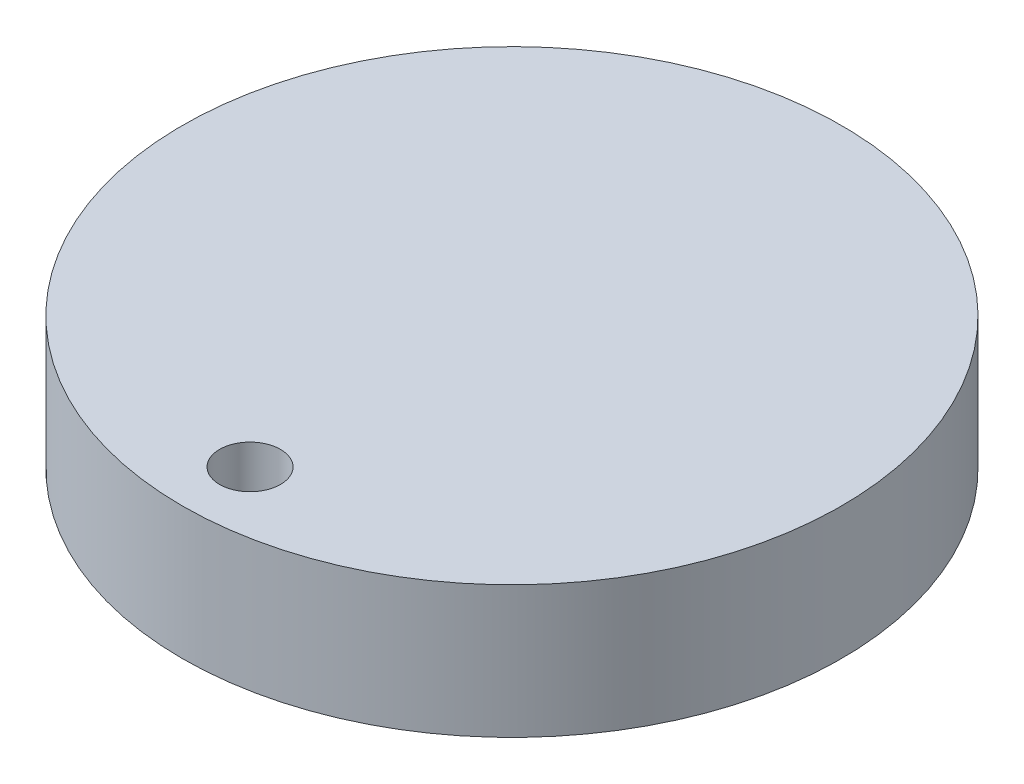
ISO-10303-21;
HEADER;
FILE_DESCRIPTION(('STEP AP214'),'2;1');
FILE_NAME('part.step','',(''),(''),'','','');
FILE_SCHEMA(('AUTOMOTIVE_DESIGN { 1 0 10303 214 1 1 1 1 }'));
ENDSEC;
DATA;
#1=APPLICATION_CONTEXT('core data for automotive mechanical design processes');
#2=APPLICATION_PROTOCOL_DEFINITION('international standard','automotive_design',2000,#1);
#3=PRODUCT_CONTEXT('',#1,'mechanical');
#4=PRODUCT('Part','Part','',(#3));
#5=PRODUCT_RELATED_PRODUCT_CATEGORY('part','',(#4));
#6=PRODUCT_DEFINITION_FORMATION('','',#4);
#7=PRODUCT_DEFINITION_CONTEXT('part definition',#1,'design');
#8=PRODUCT_DEFINITION('design','',#6,#7);
#9=PRODUCT_DEFINITION_SHAPE('','',#8);
#10=(LENGTH_UNIT() NAMED_UNIT(*) SI_UNIT(.MILLI.,.METRE.));
#11=(NAMED_UNIT(*) PLANE_ANGLE_UNIT() SI_UNIT($,.RADIAN.));
#12=(NAMED_UNIT(*) SI_UNIT($,.STERADIAN.) SOLID_ANGLE_UNIT());
#13=UNCERTAINTY_MEASURE_WITH_UNIT(LENGTH_MEASURE(1.E-05),#10,'distance_accuracy_value','');
#14=(GEOMETRIC_REPRESENTATION_CONTEXT(3) GLOBAL_UNCERTAINTY_ASSIGNED_CONTEXT((#13)) GLOBAL_UNIT_ASSIGNED_CONTEXT((#10,
#11,#12)) REPRESENTATION_CONTEXT('',''));
#15=CARTESIAN_POINT('',(0.,0.,0.));
#16=DIRECTION('',(0.,0.,1.));
#17=DIRECTION('',(1.,0.,0.));
#18=AXIS2_PLACEMENT_3D('',#15,#16,#17);
#19=CARTESIAN_POINT('',(0.,5.08,0.));
#20=DIRECTION('',(0.,1.,0.));
#21=DIRECTION('',(0.,0.,1.));
#22=AXIS2_PLACEMENT_3D('',#19,#20,#21);
#23=PLANE('',#22);
#24=CARTESIAN_POINT('',(0.,5.08,0.));
#25=DIRECTION('',(0.,1.,0.));
#26=DIRECTION('',(0.,0.,1.));
#27=AXIS2_PLACEMENT_3D('',#24,#25,#26);
#28=CIRCLE('',#27,12.662852007725);
#29=CARTESIAN_POINT('',(0.,5.08,12.662852007725));
#30=VERTEX_POINT('',#29);
#31=EDGE_CURVE('E10',#30,#30,#28,.T.);
#32=ORIENTED_EDGE('',*,*,#31,.T.);
#33=EDGE_LOOP('',(#32));
#34=FACE_BOUND('',#33,.T.);
#35=CARTESIAN_POINT('',(0.,5.08,10.0625417635084));
#36=DIRECTION('',(0.,1.,0.));
#37=DIRECTION('',(0.,0.,1.));
#38=AXIS2_PLACEMENT_3D('',#35,#36,#37);
#39=CIRCLE('',#38,1.16973637699113);
#40=CARTESIAN_POINT('',(0.,5.08,11.2322781404995));
#41=VERTEX_POINT('',#40);
#42=EDGE_CURVE('E50',#41,#41,#39,.T.);
#43=ORIENTED_EDGE('',*,*,#42,.F.);
#44=EDGE_LOOP('',(#43));
#45=FACE_BOUND('',#44,.T.);
#46=ADVANCED_FACE('F37',(#34,#45),#23,.T.);
#47=CARTESIAN_POINT('',(0.,0.,0.));
#48=DIRECTION('',(0.,1.,0.));
#49=DIRECTION('',(0.,0.,1.));
#50=AXIS2_PLACEMENT_3D('',#47,#48,#49);
#51=PLANE('',#50);
#52=CARTESIAN_POINT('',(0.,0.,0.));
#53=DIRECTION('',(0.,1.,0.));
#54=DIRECTION('',(0.,0.,1.));
#55=AXIS2_PLACEMENT_3D('',#52,#53,#54);
#56=CIRCLE('',#55,12.662852007725);
#57=CARTESIAN_POINT('',(0.,0.,12.662852007725));
#58=VERTEX_POINT('',#57);
#59=EDGE_CURVE('E41',#58,#58,#56,.T.);
#60=ORIENTED_EDGE('',*,*,#59,.F.);
#61=EDGE_LOOP('',(#60));
#62=FACE_BOUND('',#61,.T.);
#63=CARTESIAN_POINT('',(0.,0.,10.0625417635084));
#64=DIRECTION('',(0.,1.,0.));
#65=DIRECTION('',(0.,0.,1.));
#66=AXIS2_PLACEMENT_3D('',#63,#64,#65);
#67=CIRCLE('',#66,1.16973637699113);
#68=CARTESIAN_POINT('',(0.,0.,11.2322781404995));
#69=VERTEX_POINT('',#68);
#70=EDGE_CURVE('E52',#69,#69,#67,.T.);
#71=ORIENTED_EDGE('',*,*,#70,.T.);
#72=EDGE_LOOP('',(#71));
#73=FACE_BOUND('',#72,.T.);
#74=ADVANCED_FACE('F64',(#62,#73),#51,.F.);
#75=CARTESIAN_POINT('',(0.,5.08,0.));
#76=DIRECTION('',(0.,-1.,0.));
#77=DIRECTION('',(0.,0.,-1.));
#78=AXIS2_PLACEMENT_3D('',#75,#76,#77);
#79=CYLINDRICAL_SURFACE('',#78,12.662852007725);
#80=ORIENTED_EDGE('',*,*,#31,.F.);
#81=EDGE_LOOP('',(#80));
#82=FACE_BOUND('',#81,.T.);
#83=ORIENTED_EDGE('',*,*,#59,.T.);
#84=EDGE_LOOP('',(#83));
#85=FACE_BOUND('',#84,.T.);
#86=ADVANCED_FACE('F39',(#82,#85),#79,.T.);
#87=CARTESIAN_POINT('',(0.,5.08,10.0625417635084));
#88=DIRECTION('',(0.,-1.,0.));
#89=DIRECTION('',(0.,0.,-1.));
#90=AXIS2_PLACEMENT_3D('',#87,#88,#89);
#91=CYLINDRICAL_SURFACE('',#90,1.16973637699113);
#92=ORIENTED_EDGE('',*,*,#42,.T.);
#93=EDGE_LOOP('',(#92));
#94=FACE_BOUND('',#93,.T.);
#95=ORIENTED_EDGE('',*,*,#70,.F.);
#96=EDGE_LOOP('',(#95));
#97=FACE_BOUND('',#96,.T.);
#98=ADVANCED_FACE('F60',(#94,#97),#91,.F.);
#99=CLOSED_SHELL('',(#46,#74,#86,#98));
#100=MANIFOLD_SOLID_BREP('B2',#99);
#101=ADVANCED_BREP_SHAPE_REPRESENTATION('',(#18,#100),#14);
#102=SHAPE_DEFINITION_REPRESENTATION(#9,#101);
ENDSEC;
END-ISO-10303-21;
